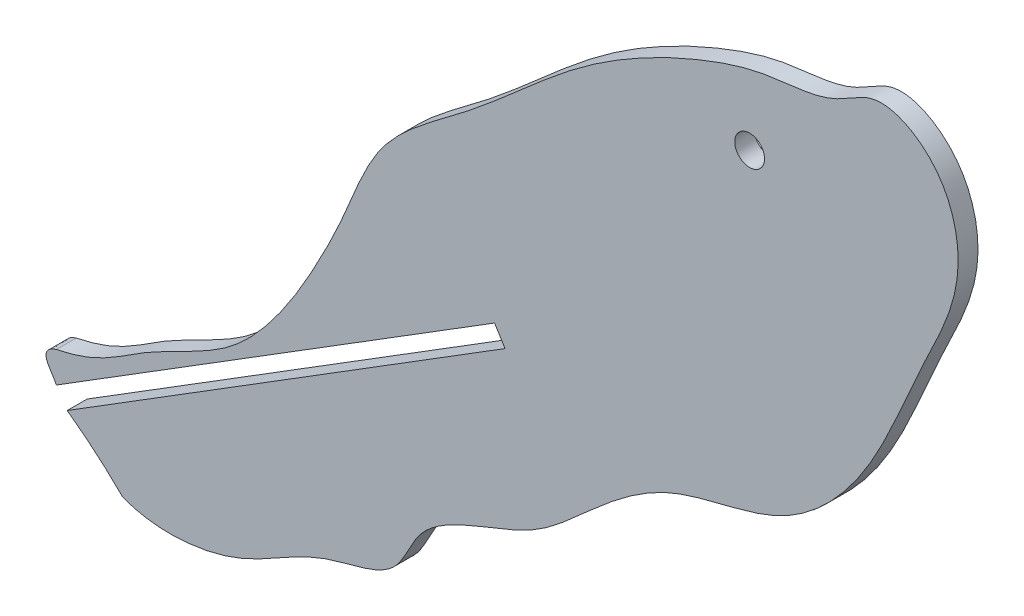
ISO-10303-21;
HEADER;
FILE_DESCRIPTION(('STEP AP214'),'2;1');
FILE_NAME('part.step','',(''),(''),'','','');
FILE_SCHEMA(('AUTOMOTIVE_DESIGN { 1 0 10303 214 1 1 1 1 }'));
ENDSEC;
DATA;
#1=APPLICATION_CONTEXT('core data for automotive mechanical design processes');
#2=APPLICATION_PROTOCOL_DEFINITION('international standard','automotive_design',2000,#1);
#3=PRODUCT_CONTEXT('',#1,'mechanical');
#4=PRODUCT('Part','Part','',(#3));
#5=PRODUCT_RELATED_PRODUCT_CATEGORY('part','',(#4));
#6=PRODUCT_DEFINITION_FORMATION('','',#4);
#7=PRODUCT_DEFINITION_CONTEXT('part definition',#1,'design');
#8=PRODUCT_DEFINITION('design','',#6,#7);
#9=PRODUCT_DEFINITION_SHAPE('','',#8);
#10=(LENGTH_UNIT() NAMED_UNIT(*) SI_UNIT(.MILLI.,.METRE.));
#11=(NAMED_UNIT(*) PLANE_ANGLE_UNIT() SI_UNIT($,.RADIAN.));
#12=(NAMED_UNIT(*) SI_UNIT($,.STERADIAN.) SOLID_ANGLE_UNIT());
#13=UNCERTAINTY_MEASURE_WITH_UNIT(LENGTH_MEASURE(1.E-05),#10,'distance_accuracy_value','');
#14=(GEOMETRIC_REPRESENTATION_CONTEXT(3) GLOBAL_UNCERTAINTY_ASSIGNED_CONTEXT((#13)) GLOBAL_UNIT_ASSIGNED_CONTEXT((#10,
#11,#12)) REPRESENTATION_CONTEXT('',''));
#15=CARTESIAN_POINT('',(0.,0.,0.));
#16=DIRECTION('',(0.,0.,1.));
#17=DIRECTION('',(1.,0.,0.));
#18=AXIS2_PLACEMENT_3D('',#15,#16,#17);
#19=CARTESIAN_POINT('',(187.103358108975,282.093388206899,3.175));
#20=DIRECTION('',(0.,0.,-1.));
#21=DIRECTION('',(-1.,0.,0.));
#22=AXIS2_PLACEMENT_3D('',#19,#20,#21);
#23=PLANE('',#22);
#24=CARTESIAN_POINT('',(43.521756825532,182.427259653709,3.175));
#25=CARTESIAN_POINT('',(44.7887503826752,181.763287530113,3.175));
#26=CARTESIAN_POINT('',(48.1265338542322,180.605526568662,3.175));
#27=CARTESIAN_POINT('',(53.7050453815265,175.728575889343,3.175));
#28=CARTESIAN_POINT('',(63.3223674122011,174.351807674449,3.175));
#29=CARTESIAN_POINT('',(75.4552537828246,177.048714088527,3.175));
#30=CARTESIAN_POINT('',(85.4077883988649,184.743599328159,3.175));
#31=CARTESIAN_POINT('',(98.3800900925353,186.107930878049,3.175));
#32=CARTESIAN_POINT('',(101.467051899084,195.524505013362,3.175));
#33=CARTESIAN_POINT('',(109.919319881027,200.514587773866,3.175));
#34=CARTESIAN_POINT('',(120.665380591227,203.617021345167,3.175));
#35=CARTESIAN_POINT('',(130.419274080011,213.061934573532,3.175));
#36=CARTESIAN_POINT('',(142.549134865909,222.570268934747,3.175));
#37=CARTESIAN_POINT('',(160.393689469278,224.081902494308,3.175));
#38=CARTESIAN_POINT('',(174.641301479803,238.852254234112,3.175));
#39=CARTESIAN_POINT('',(181.053723680591,256.586171695297,3.175));
#40=CARTESIAN_POINT('',(190.15605861825,272.865915288256,3.175));
#41=CARTESIAN_POINT('',(186.171272478843,287.724417803504,3.175));
#42=CARTESIAN_POINT('',(175.242212468009,293.10305282077,3.175));
#43=CARTESIAN_POINT('',(167.541303274987,286.786726966751,3.175));
#44=CARTESIAN_POINT('',(157.728162565191,286.776771149081,3.175));
#45=CARTESIAN_POINT('',(143.796374698425,282.153767947254,3.175));
#46=CARTESIAN_POINT('',(126.785607672265,272.999703707221,3.175));
#47=CARTESIAN_POINT('',(111.702283176836,257.849735430913,3.175));
#48=CARTESIAN_POINT('',(95.3695742354218,247.282489302245,3.175));
#49=CARTESIAN_POINT('',(90.6008384963553,233.821235852936,3.175));
#50=CARTESIAN_POINT('',(85.0690005718059,222.636711039724,3.175));
#51=CARTESIAN_POINT('',(79.3323503252193,213.030247768259,3.175));
#52=CARTESIAN_POINT('',(70.5634930082747,203.671709206406,3.175));
#53=CARTESIAN_POINT('',(58.0881453566878,198.920146382851,3.175));
#54=CARTESIAN_POINT('',(49.8665510998634,191.787864634931,3.175));
#55=CARTESIAN_POINT('',(36.7522452310281,190.436464274981,3.175));
#56=CARTESIAN_POINT('',(39.5188331470719,185.745298555528,3.175));
#57=CARTESIAN_POINT('',(40.7681458457334,184.453070521838,3.175));
#58=B_SPLINE_CURVE_WITH_KNOTS('',3,(#24,#25,#26,#27,#28,#29,#30,#31,#32,#33,#34,#35,#36,#37,#38,
#39,#40,#41,#42,#43,#44,#45,#46,#47,#48,#49,#50,#51,#52,#53,#54,#55,#56,#57),.UNSPECIFIED.,.F.,
.F.,(4,1,1,1,1,1,1,1,1,1,1,1,1,1,1,1,1,1,1,1,1,1,1,1,1,1,1,1,1,1,1,4),(0.,0.010738040669912,
0.0276137682849945,0.0537055499794893,0.0804700682373782,0.119119448728971,0.148684449618889,
0.166041763174118,0.187193332634009,0.219521226012507,0.249444867117344,0.287922406536559,
0.333236134958788,0.377488775219618,0.432665243117642,0.476723880216405,0.51286644581982,
0.536093959317077,0.553131728135513,0.581565298615239,0.607650884944172,0.663372441196613,
0.724739811787031,0.769453902624374,0.804289373627514,0.8289545577815,0.863970512672084,
0.888092373381754,0.924484508370759,0.959068523682572,0.980197156317216,0.99194032854892),.UNSPECIFIED.);
#59=CARTESIAN_POINT('',(54.6512950804427,176.265765907498,3.17499999999998));
#60=VERTEX_POINT('',#59);
#61=CARTESIAN_POINT('',(44.0391488082228,191.407071504672,3.17499999999998));
#62=VERTEX_POINT('',#61);
#63=EDGE_CURVE('E124',#60,#62,#58,.T.);
#64=ORIENTED_EDGE('',*,*,#63,.T.);
#65=CARTESIAN_POINT('',(44.0391488121275,186.489199169507,3.17499999999998));
#66=CARTESIAN_POINT('',(43.3127466497987,188.083473633177,3.17499999999998));
#67=CARTESIAN_POINT('',(40.7005142288085,190.310137172608,3.17499999999998));
#68=CARTESIAN_POINT('',(44.0391488115873,191.407071505447,3.17499999999998));
#69=B_SPLINE_CURVE_WITH_KNOTS('',3,(#65,#66,#67,#68),.UNSPECIFIED.,.F.,.F.,(4,4),(0.,1.),.UNSPECIFIED.);
#70=CARTESIAN_POINT('',(44.0391488121275,186.489199169507,3.17499999999998));
#71=VERTEX_POINT('',#70);
#72=EDGE_CURVE('E87',#71,#62,#69,.T.);
#73=ORIENTED_EDGE('',*,*,#72,.F.);
#74=DIRECTION('',(0.848959040136876,0.528458653226413,0.));
#75=VECTOR('',#74,1.);
#76=CARTESIAN_POINT('',(40.7681458457334,184.453070521838,3.175));
#77=LINE('',#76,#75);
#78=CARTESIAN_POINT('',(114.077670793492,230.086665302,3.175));
#79=VERTEX_POINT('',#78);
#80=EDGE_CURVE('E119',#71,#79,#77,.T.);
#81=ORIENTED_EDGE('',*,*,#80,.T.);
#82=DIRECTION('',(0.52845865322641,-0.848959040136878,0.));
#83=VECTOR('',#82,1.);
#84=CARTESIAN_POINT('',(114.077670793492,230.086665302,3.175));
#85=LINE('',#84,#83);
#86=CARTESIAN_POINT('',(115.755527017486,227.391220349565,3.175));
#87=VERTEX_POINT('',#86);
#88=EDGE_CURVE('E107',#79,#87,#85,.T.);
#89=ORIENTED_EDGE('',*,*,#88,.T.);
#90=DIRECTION('',(-0.848959040136876,-0.528458653226413,0.));
#91=VECTOR('',#90,1.);
#92=CARTESIAN_POINT('',(115.755527017486,227.391220349565,3.175));
#93=LINE('',#92,#91);
#94=CARTESIAN_POINT('',(45.7699550948054,183.82671448415,3.17499999999998));
#95=VERTEX_POINT('',#94);
#96=EDGE_CURVE('E129',#87,#95,#93,.T.);
#97=ORIENTED_EDGE('',*,*,#96,.T.);
#98=CARTESIAN_POINT('',(54.6512950804429,176.265765907498,3.17499999999998));
#99=CARTESIAN_POINT('',(50.5118545477409,180.405739419972,3.17499999999998));
#100=CARTESIAN_POINT('',(45.7699550948054,183.82671448415,3.17499999999998));
#101=B_SPLINE_CURVE_WITH_KNOTS('',2,(#98,#99,#100),.UNSPECIFIED.,.F.,.F.,(3,3),(0.,1.),.UNSPECIFIED.);
#102=EDGE_CURVE('E102',#60,#95,#101,.T.);
#103=ORIENTED_EDGE('',*,*,#102,.F.);
#104=EDGE_LOOP('',(#64,#73,#81,#89,#97,#103));
#105=FACE_BOUND('',#104,.T.);
#106=CARTESIAN_POINT('',(154.849064278729,274.384345547725,3.175));
#107=DIRECTION('',(0.,0.,1.));
#108=DIRECTION('',(1.,0.,0.));
#109=AXIS2_PLACEMENT_3D('',#106,#107,#108);
#110=CIRCLE('',#109,2.38125000000001);
#111=CARTESIAN_POINT('',(157.230314278729,274.384345547725,3.175));
#112=VERTEX_POINT('',#111);
#113=EDGE_CURVE('E135',#112,#112,#110,.T.);
#114=ORIENTED_EDGE('',*,*,#113,.F.);
#115=EDGE_LOOP('',(#114));
#116=FACE_BOUND('',#115,.T.);
#117=ADVANCED_FACE('F33',(#105,#116),#23,.F.);
#118=CARTESIAN_POINT('',(187.103358108975,282.093388206899,0.));
#119=DIRECTION('',(0.,0.,-1.));
#120=DIRECTION('',(-1.,0.,0.));
#121=AXIS2_PLACEMENT_3D('',#118,#119,#120);
#122=PLANE('',#121);
#123=CARTESIAN_POINT('',(44.0391488121275,186.489199169507,0.));
#124=CARTESIAN_POINT('',(43.3127466497987,188.083473633177,0.));
#125=CARTESIAN_POINT('',(40.7005142288085,190.310137172608,0.));
#126=CARTESIAN_POINT('',(44.0391488115873,191.407071505447,0.));
#127=B_SPLINE_CURVE_WITH_KNOTS('',3,(#123,#124,#125,#126),.UNSPECIFIED.,.F.,.F.,(4,4),(0.,1.),.UNSPECIFIED.);
#128=CARTESIAN_POINT('',(44.0391488121273,186.489199169507,0.));
#129=VERTEX_POINT('',#128);
#130=CARTESIAN_POINT('',(44.0391488082228,191.407071504672,0.));
#131=VERTEX_POINT('',#130);
#132=EDGE_CURVE('E56',#129,#131,#127,.T.);
#133=ORIENTED_EDGE('',*,*,#132,.T.);
#134=CARTESIAN_POINT('',(43.521756825532,182.427259653709,0.));
#135=CARTESIAN_POINT('',(44.7887503826752,181.763287530113,0.));
#136=CARTESIAN_POINT('',(48.1265338542322,180.605526568662,0.));
#137=CARTESIAN_POINT('',(53.7050453815265,175.728575889343,0.));
#138=CARTESIAN_POINT('',(63.3223674122011,174.351807674449,0.));
#139=CARTESIAN_POINT('',(75.4552537828246,177.048714088527,0.));
#140=CARTESIAN_POINT('',(85.4077883988649,184.743599328159,0.));
#141=CARTESIAN_POINT('',(98.3800900925353,186.107930878049,0.));
#142=CARTESIAN_POINT('',(101.467051899084,195.524505013362,0.));
#143=CARTESIAN_POINT('',(109.919319881027,200.514587773866,0.));
#144=CARTESIAN_POINT('',(120.665380591227,203.617021345167,0.));
#145=CARTESIAN_POINT('',(130.419274080011,213.061934573532,0.));
#146=CARTESIAN_POINT('',(142.549134865909,222.570268934747,0.));
#147=CARTESIAN_POINT('',(160.393689469278,224.081902494308,0.));
#148=CARTESIAN_POINT('',(174.641301479803,238.852254234112,0.));
#149=CARTESIAN_POINT('',(181.053723680591,256.586171695297,0.));
#150=CARTESIAN_POINT('',(190.15605861825,272.865915288256,0.));
#151=CARTESIAN_POINT('',(186.171272478843,287.724417803504,0.));
#152=CARTESIAN_POINT('',(175.242212468009,293.10305282077,0.));
#153=CARTESIAN_POINT('',(167.541303274987,286.786726966751,0.));
#154=CARTESIAN_POINT('',(157.728162565191,286.776771149081,0.));
#155=CARTESIAN_POINT('',(143.796374698425,282.153767947254,0.));
#156=CARTESIAN_POINT('',(126.785607672265,272.999703707221,0.));
#157=CARTESIAN_POINT('',(111.702283176836,257.849735430913,0.));
#158=CARTESIAN_POINT('',(95.3695742354218,247.282489302245,0.));
#159=CARTESIAN_POINT('',(90.6008384963553,233.821235852936,0.));
#160=CARTESIAN_POINT('',(85.0690005718059,222.636711039724,0.));
#161=CARTESIAN_POINT('',(79.3323503252193,213.030247768259,0.));
#162=CARTESIAN_POINT('',(70.5634930082747,203.671709206406,0.));
#163=CARTESIAN_POINT('',(58.0881453566878,198.920146382851,0.));
#164=CARTESIAN_POINT('',(49.8665510998634,191.787864634931,0.));
#165=CARTESIAN_POINT('',(36.7522452310281,190.436464274981,0.));
#166=CARTESIAN_POINT('',(39.5188331470719,185.745298555528,0.));
#167=CARTESIAN_POINT('',(40.7681458457334,184.453070521838,0.));
#168=B_SPLINE_CURVE_WITH_KNOTS('',3,(#134,#135,#136,#137,#138,#139,#140,#141,#142,#143,#144,
#145,#146,#147,#148,#149,#150,#151,#152,#153,#154,#155,#156,#157,#158,#159,#160,#161,#162,#163,
#164,#165,#166,#167),.UNSPECIFIED.,.F.,.F.,(4,1,1,1,1,1,1,1,1,1,1,1,1,1,1,1,1,1,1,1,1,1,1,1,1,1,
1,1,1,1,1,4),(0.,0.010738040669912,0.0276137682849945,0.0537055499794893,0.0804700682373782,
0.119119448728971,0.148684449618889,0.166041763174118,0.187193332634009,0.219521226012507,
0.249444867117344,0.287922406536559,0.333236134958788,0.377488775219618,0.432665243117642,
0.476723880216405,0.51286644581982,0.536093959317077,0.553131728135513,0.581565298615239,
0.607650884944172,0.663372441196613,0.724739811787031,0.769453902624374,0.804289373627514,
0.8289545577815,0.863970512672084,0.888092373381754,0.924484508370759,0.959068523682572,
0.980197156317216,0.99194032854892),.UNSPECIFIED.);
#169=CARTESIAN_POINT('',(54.6512950804277,176.265765907504,0.));
#170=VERTEX_POINT('',#169);
#171=EDGE_CURVE('E99',#170,#131,#168,.T.);
#172=ORIENTED_EDGE('',*,*,#171,.F.);
#173=CARTESIAN_POINT('',(54.6512950804429,176.265765907498,0.));
#174=CARTESIAN_POINT('',(50.5118545477409,180.405739419972,0.));
#175=CARTESIAN_POINT('',(45.7699550948054,183.82671448415,0.));
#176=B_SPLINE_CURVE_WITH_KNOTS('',2,(#173,#174,#175),.UNSPECIFIED.,.F.,.F.,(3,3),(0.,1.),.UNSPECIFIED.);
#177=CARTESIAN_POINT('',(45.7699550948054,183.82671448415,0.));
#178=VERTEX_POINT('',#177);
#179=EDGE_CURVE('E48',#170,#178,#176,.T.);
#180=ORIENTED_EDGE('',*,*,#179,.T.);
#181=DIRECTION('',(-0.848959040136876,-0.528458653226413,0.));
#182=VECTOR('',#181,1.);
#183=CARTESIAN_POINT('',(115.755527017486,227.391220349565,0.));
#184=LINE('',#183,#182);
#185=CARTESIAN_POINT('',(115.755527017486,227.391220349565,0.));
#186=VERTEX_POINT('',#185);
#187=EDGE_CURVE('E105',#186,#178,#184,.T.);
#188=ORIENTED_EDGE('',*,*,#187,.F.);
#189=DIRECTION('',(0.52845865322641,-0.848959040136878,0.));
#190=VECTOR('',#189,1.);
#191=CARTESIAN_POINT('',(114.077670793492,230.086665302,0.));
#192=LINE('',#191,#190);
#193=CARTESIAN_POINT('',(114.077670793492,230.086665302,0.));
#194=VERTEX_POINT('',#193);
#195=EDGE_CURVE('E110',#194,#186,#192,.T.);
#196=ORIENTED_EDGE('',*,*,#195,.F.);
#197=DIRECTION('',(0.848959040136876,0.528458653226413,0.));
#198=VECTOR('',#197,1.);
#199=CARTESIAN_POINT('',(40.7681458457334,184.453070521838,0.));
#200=LINE('',#199,#198);
#201=EDGE_CURVE('E101',#129,#194,#200,.T.);
#202=ORIENTED_EDGE('',*,*,#201,.F.);
#203=EDGE_LOOP('',(#133,#172,#180,#188,#196,#202));
#204=FACE_BOUND('',#203,.T.);
#205=CARTESIAN_POINT('',(154.849064278729,274.384345547725,0.));
#206=DIRECTION('',(0.,0.,1.));
#207=DIRECTION('',(1.,0.,0.));
#208=AXIS2_PLACEMENT_3D('',#205,#206,#207);
#209=CIRCLE('',#208,2.38125000000001);
#210=CARTESIAN_POINT('',(157.230314278729,274.384345547725,0.));
#211=VERTEX_POINT('',#210);
#212=EDGE_CURVE('E138',#211,#211,#209,.T.);
#213=ORIENTED_EDGE('',*,*,#212,.T.);
#214=EDGE_LOOP('',(#213));
#215=FACE_BOUND('',#214,.T.);
#216=ADVANCED_FACE('F97',(#204,#215),#122,.T.);
#217=CARTESIAN_POINT('',(114.077670793492,230.086665302,3.175));
#218=DIRECTION('',(0.848959040136878,0.52845865322641,0.));
#219=DIRECTION('',(-0.52845865322641,0.848959040136878,0.));
#220=AXIS2_PLACEMENT_3D('',#217,#218,#219);
#221=PLANE('',#220);
#222=ORIENTED_EDGE('',*,*,#195,.T.);
#223=DIRECTION('',(0.,0.,-1.));
#224=VECTOR('',#223,1.);
#225=CARTESIAN_POINT('',(115.755527017486,227.391220349565,3.175));
#226=LINE('',#225,#224);
#227=EDGE_CURVE('E11',#87,#186,#226,.T.);
#228=ORIENTED_EDGE('',*,*,#227,.F.);
#229=ORIENTED_EDGE('',*,*,#88,.F.);
#230=DIRECTION('',(0.,0.,-1.));
#231=VECTOR('',#230,1.);
#232=CARTESIAN_POINT('',(114.077670793492,230.086665302,3.175));
#233=LINE('',#232,#231);
#234=EDGE_CURVE('E41',#79,#194,#233,.T.);
#235=ORIENTED_EDGE('',*,*,#234,.T.);
#236=EDGE_LOOP('',(#222,#228,#229,#235));
#237=FACE_BOUND('',#236,.T.);
#238=ADVANCED_FACE('F35',(#237),#221,.F.);
#239=CARTESIAN_POINT('',(115.755527017486,227.391220349565,3.175));
#240=DIRECTION('',(0.528458653226413,-0.848959040136876,0.));
#241=DIRECTION('',(0.848959040136876,0.528458653226413,0.));
#242=AXIS2_PLACEMENT_3D('',#239,#240,#241);
#243=PLANE('',#242);
#244=ORIENTED_EDGE('',*,*,#187,.T.);
#245=DIRECTION('',(0.,0.,1.));
#246=VECTOR('',#245,1.);
#247=CARTESIAN_POINT('',(45.7699550948054,183.82671448415,0.));
#248=LINE('',#247,#246);
#249=EDGE_CURVE('E153',#178,#95,#248,.T.);
#250=ORIENTED_EDGE('',*,*,#249,.T.);
#251=ORIENTED_EDGE('',*,*,#96,.F.);
#252=ORIENTED_EDGE('',*,*,#227,.T.);
#253=EDGE_LOOP('',(#244,#250,#251,#252));
#254=FACE_BOUND('',#253,.T.);
#255=ADVANCED_FACE('F152',(#254),#243,.F.);
#256=DIRECTION('',(0.,0.,-1.));
#257=VECTOR('',#256,1.);
#258=SURFACE_OF_LINEAR_EXTRUSION('',#58,#257);
#259=ORIENTED_EDGE('',*,*,#63,.F.);
#260=DIRECTION('',(0.,0.,1.));
#261=VECTOR('',#260,1.);
#262=CARTESIAN_POINT('',(54.6512950804427,176.265765907498,0.));
#263=LINE('',#262,#261);
#264=EDGE_CURVE('E92',#170,#60,#263,.T.);
#265=ORIENTED_EDGE('',*,*,#264,.F.);
#266=ORIENTED_EDGE('',*,*,#171,.T.);
#267=DIRECTION('',(0.,0.,1.));
#268=VECTOR('',#267,1.);
#269=CARTESIAN_POINT('',(44.0391488082228,191.407071504672,0.));
#270=LINE('',#269,#268);
#271=EDGE_CURVE('E84',#131,#62,#270,.T.);
#272=ORIENTED_EDGE('',*,*,#271,.T.);
#273=EDGE_LOOP('',(#259,#265,#266,#272));
#274=FACE_BOUND('',#273,.T.);
#275=ADVANCED_FACE('F104',(#274),#258,.F.);
#276=CARTESIAN_POINT('',(40.7681458457334,184.453070521838,3.175));
#277=DIRECTION('',(-0.528458653226413,0.848959040136876,0.));
#278=DIRECTION('',(-0.848959040136876,-0.528458653226413,0.));
#279=AXIS2_PLACEMENT_3D('',#276,#277,#278);
#280=PLANE('',#279);
#281=ORIENTED_EDGE('',*,*,#80,.F.);
#282=DIRECTION('',(0.,0.,1.));
#283=VECTOR('',#282,1.);
#284=CARTESIAN_POINT('',(44.0391488121275,186.489199169507,0.));
#285=LINE('',#284,#283);
#286=EDGE_CURVE('E143',#129,#71,#285,.T.);
#287=ORIENTED_EDGE('',*,*,#286,.F.);
#288=ORIENTED_EDGE('',*,*,#201,.T.);
#289=ORIENTED_EDGE('',*,*,#234,.F.);
#290=EDGE_LOOP('',(#281,#287,#288,#289));
#291=FACE_BOUND('',#290,.T.);
#292=ADVANCED_FACE('F187',(#291),#280,.F.);
#293=CARTESIAN_POINT('',(154.849064278729,274.384345547725,3.175));
#294=DIRECTION('',(0.,0.,-1.));
#295=DIRECTION('',(-1.,0.,0.));
#296=AXIS2_PLACEMENT_3D('',#293,#294,#295);
#297=CYLINDRICAL_SURFACE('',#296,2.38125000000001);
#298=ORIENTED_EDGE('',*,*,#113,.T.);
#299=EDGE_LOOP('',(#298));
#300=FACE_BOUND('',#299,.T.);
#301=ORIENTED_EDGE('',*,*,#212,.F.);
#302=EDGE_LOOP('',(#301));
#303=FACE_BOUND('',#302,.T.);
#304=ADVANCED_FACE('F184',(#300,#303),#297,.F.);
#305=DIRECTION('',(0.,0.,1.));
#306=VECTOR('',#305,1.);
#307=SURFACE_OF_LINEAR_EXTRUSION('',#127,#306);
#308=ORIENTED_EDGE('',*,*,#72,.T.);
#309=ORIENTED_EDGE('',*,*,#271,.F.);
#310=ORIENTED_EDGE('',*,*,#132,.F.);
#311=ORIENTED_EDGE('',*,*,#286,.T.);
#312=EDGE_LOOP('',(#308,#309,#310,#311));
#313=FACE_BOUND('',#312,.T.);
#314=ADVANCED_FACE('F85',(#313),#307,.F.);
#315=DIRECTION('',(0.,0.,1.));
#316=VECTOR('',#315,1.);
#317=SURFACE_OF_LINEAR_EXTRUSION('',#176,#316);
#318=ORIENTED_EDGE('',*,*,#102,.T.);
#319=ORIENTED_EDGE('',*,*,#249,.F.);
#320=ORIENTED_EDGE('',*,*,#179,.F.);
#321=ORIENTED_EDGE('',*,*,#264,.T.);
#322=EDGE_LOOP('',(#318,#319,#320,#321));
#323=FACE_BOUND('',#322,.T.);
#324=ADVANCED_FACE('F179',(#323),#317,.F.);
#325=CLOSED_SHELL('',(#117,#216,#238,#255,#275,#292,#304,#314,#324));
#326=MANIFOLD_SOLID_BREP('B2',#325);
#327=ADVANCED_BREP_SHAPE_REPRESENTATION('',(#18,#326),#14);
#328=SHAPE_DEFINITION_REPRESENTATION(#9,#327);
ENDSEC;
END-ISO-10303-21;
